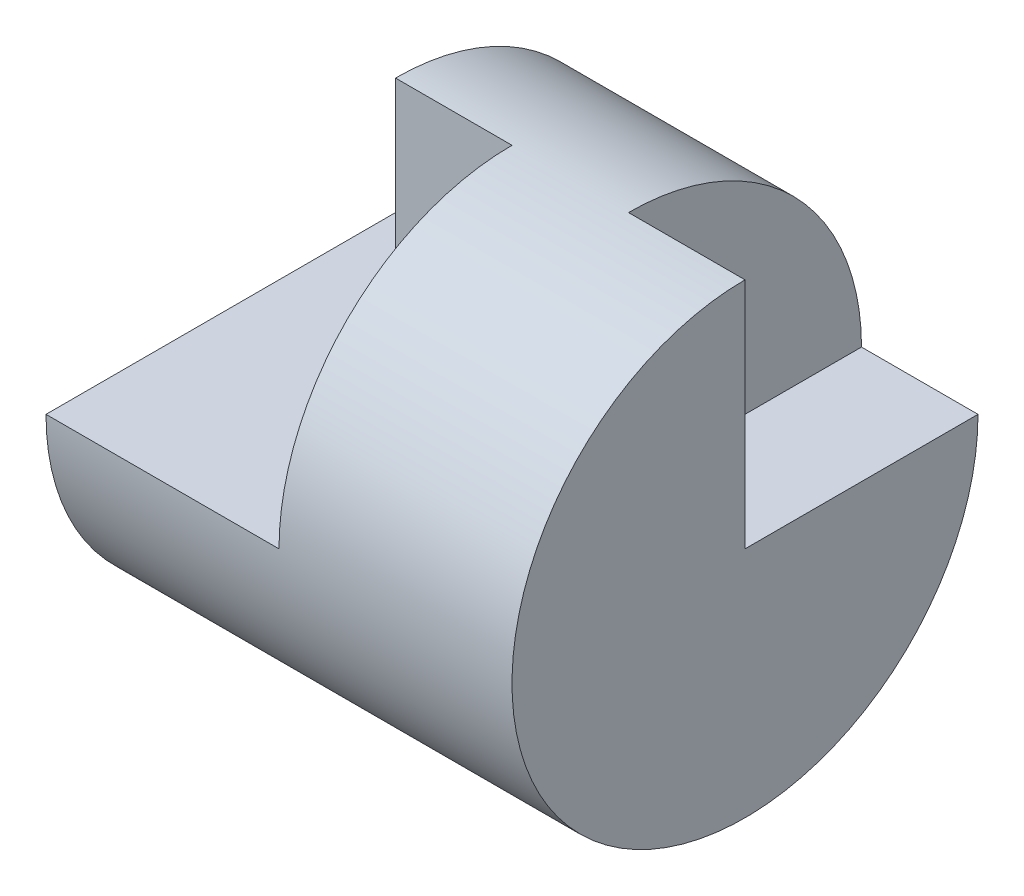
ISO-10303-21;
HEADER;
FILE_DESCRIPTION(('STEP AP214'),'2;1');
FILE_NAME('part.step','',(''),(''),'','','');
FILE_SCHEMA(('AUTOMOTIVE_DESIGN { 1 0 10303 214 1 1 1 1 }'));
ENDSEC;
DATA;
#1=APPLICATION_CONTEXT('core data for automotive mechanical design processes');
#2=APPLICATION_PROTOCOL_DEFINITION('international standard','automotive_design',2000,#1);
#3=PRODUCT_CONTEXT('',#1,'mechanical');
#4=PRODUCT('Part','Part','',(#3));
#5=PRODUCT_RELATED_PRODUCT_CATEGORY('part','',(#4));
#6=PRODUCT_DEFINITION_FORMATION('','',#4);
#7=PRODUCT_DEFINITION_CONTEXT('part definition',#1,'design');
#8=PRODUCT_DEFINITION('design','',#6,#7);
#9=PRODUCT_DEFINITION_SHAPE('','',#8);
#10=(LENGTH_UNIT() NAMED_UNIT(*) SI_UNIT(.MILLI.,.METRE.));
#11=(NAMED_UNIT(*) PLANE_ANGLE_UNIT() SI_UNIT($,.RADIAN.));
#12=(NAMED_UNIT(*) SI_UNIT($,.STERADIAN.) SOLID_ANGLE_UNIT());
#13=UNCERTAINTY_MEASURE_WITH_UNIT(LENGTH_MEASURE(1.E-05),#10,'distance_accuracy_value','');
#14=(GEOMETRIC_REPRESENTATION_CONTEXT(3) GLOBAL_UNCERTAINTY_ASSIGNED_CONTEXT((#13)) GLOBAL_UNIT_ASSIGNED_CONTEXT((#10,
#11,#12)) REPRESENTATION_CONTEXT('',''));
#15=CARTESIAN_POINT('',(0.,0.,0.));
#16=DIRECTION('',(0.,0.,1.));
#17=DIRECTION('',(1.,0.,0.));
#18=AXIS2_PLACEMENT_3D('',#15,#16,#17);
#19=CARTESIAN_POINT('',(0.,0.,0.));
#20=DIRECTION('',(-1.,0.,0.));
#21=DIRECTION('',(0.,0.,1.));
#22=AXIS2_PLACEMENT_3D('',#19,#20,#21);
#23=CYLINDRICAL_SURFACE('',#22,2.);
#24=CARTESIAN_POINT('',(2.,0.,0.));
#25=DIRECTION('',(1.,0.,0.));
#26=DIRECTION('',(0.,0.,-1.));
#27=AXIS2_PLACEMENT_3D('',#24,#25,#26);
#28=CIRCLE('',#27,2.);
#29=CARTESIAN_POINT('',(2.,0.,2.));
#30=VERTEX_POINT('',#29);
#31=CARTESIAN_POINT('',(2.,2.,0.));
#32=VERTEX_POINT('',#31);
#33=EDGE_CURVE('E11',#30,#32,#28,.F.);
#34=ORIENTED_EDGE('',*,*,#33,.F.);
#35=DIRECTION('',(-1.,0.,0.));
#36=VECTOR('',#35,1.);
#37=CARTESIAN_POINT('',(0.,0.,2.));
#38=LINE('',#37,#36);
#39=CARTESIAN_POINT('',(0.,0.,2.));
#40=VERTEX_POINT('',#39);
#41=EDGE_CURVE('E115',#40,#30,#38,.F.);
#42=ORIENTED_EDGE('',*,*,#41,.F.);
#43=CARTESIAN_POINT('',(0.,0.,0.));
#44=DIRECTION('',(-1.,0.,0.));
#45=DIRECTION('',(0.,0.,1.));
#46=AXIS2_PLACEMENT_3D('',#43,#44,#45);
#47=CIRCLE('',#46,2.);
#48=CARTESIAN_POINT('',(0.,0.,-2.));
#49=VERTEX_POINT('',#48);
#50=EDGE_CURVE('E140',#49,#40,#47,.T.);
#51=ORIENTED_EDGE('',*,*,#50,.F.);
#52=DIRECTION('',(-1.,0.,0.));
#53=VECTOR('',#52,1.);
#54=CARTESIAN_POINT('',(0.,0.,-2.));
#55=LINE('',#54,#53);
#56=CARTESIAN_POINT('',(1.,0.,-2.));
#57=VERTEX_POINT('',#56);
#58=EDGE_CURVE('E122',#57,#49,#55,.T.);
#59=ORIENTED_EDGE('',*,*,#58,.F.);
#60=CARTESIAN_POINT('',(1.,0.,0.));
#61=DIRECTION('',(-1.,0.,0.));
#62=DIRECTION('',(0.,-1.,0.));
#63=AXIS2_PLACEMENT_3D('',#60,#61,#62);
#64=CIRCLE('',#63,2.);
#65=CARTESIAN_POINT('',(1.,2.,0.));
#66=VERTEX_POINT('',#65);
#67=EDGE_CURVE('E40',#57,#66,#64,.F.);
#68=ORIENTED_EDGE('',*,*,#67,.T.);
#69=DIRECTION('',(1.,0.,0.));
#70=VECTOR('',#69,1.);
#71=CARTESIAN_POINT('',(0.5,2.,0.));
#72=LINE('',#71,#70);
#73=EDGE_CURVE('E103',#66,#32,#72,.T.);
#74=ORIENTED_EDGE('',*,*,#73,.T.);
#75=EDGE_LOOP('',(#34,#42,#51,#59,#68,#74));
#76=FACE_BOUND('',#75,.T.);
#77=CARTESIAN_POINT('',(3.,0.,0.));
#78=DIRECTION('',(-1.,0.,0.));
#79=DIRECTION('',(0.,-1.,0.));
#80=AXIS2_PLACEMENT_3D('',#77,#78,#79);
#81=CIRCLE('',#80,2.);
#82=CARTESIAN_POINT('',(3.,0.,-2.));
#83=VERTEX_POINT('',#82);
#84=CARTESIAN_POINT('',(3.,2.,0.));
#85=VERTEX_POINT('',#84);
#86=EDGE_CURVE('E144',#83,#85,#81,.F.);
#87=ORIENTED_EDGE('',*,*,#86,.F.);
#88=DIRECTION('',(-1.,0.,0.));
#89=VECTOR('',#88,1.);
#90=CARTESIAN_POINT('',(0.,0.,-2.));
#91=LINE('',#90,#89);
#92=CARTESIAN_POINT('',(4.,0.,-2.));
#93=VERTEX_POINT('',#92);
#94=EDGE_CURVE('E135',#83,#93,#91,.F.);
#95=ORIENTED_EDGE('',*,*,#94,.T.);
#96=CARTESIAN_POINT('',(4.,0.,0.));
#97=DIRECTION('',(-1.,0.,0.));
#98=DIRECTION('',(0.,0.,1.));
#99=AXIS2_PLACEMENT_3D('',#96,#97,#98);
#100=CIRCLE('',#99,2.);
#101=CARTESIAN_POINT('',(4.,2.,0.));
#102=VERTEX_POINT('',#101);
#103=EDGE_CURVE('E137',#93,#102,#100,.T.);
#104=ORIENTED_EDGE('',*,*,#103,.T.);
#105=DIRECTION('',(-1.,0.,0.));
#106=VECTOR('',#105,1.);
#107=CARTESIAN_POINT('',(0.,2.,0.));
#108=LINE('',#107,#106);
#109=EDGE_CURVE('E47',#102,#85,#108,.T.);
#110=ORIENTED_EDGE('',*,*,#109,.T.);
#111=EDGE_LOOP('',(#87,#95,#104,#110));
#112=FACE_BOUND('',#111,.T.);
#113=ADVANCED_FACE('F33',(#76,#112),#23,.T.);
#114=CARTESIAN_POINT('',(4.,0.,0.));
#115=DIRECTION('',(-1.,0.,0.));
#116=DIRECTION('',(0.,0.,1.));
#117=AXIS2_PLACEMENT_3D('',#114,#115,#116);
#118=PLANE('',#117);
#119=DIRECTION('',(0.,0.,-1.));
#120=VECTOR('',#119,1.);
#121=CARTESIAN_POINT('',(4.,0.,0.));
#122=LINE('',#121,#120);
#123=CARTESIAN_POINT('',(4.,0.,0.));
#124=VERTEX_POINT('',#123);
#125=EDGE_CURVE('E55',#124,#93,#122,.T.);
#126=ORIENTED_EDGE('',*,*,#125,.F.);
#127=DIRECTION('',(0.,-1.,0.));
#128=VECTOR('',#127,1.);
#129=CARTESIAN_POINT('',(4.,0.,0.));
#130=LINE('',#129,#128);
#131=EDGE_CURVE('E131',#102,#124,#130,.T.);
#132=ORIENTED_EDGE('',*,*,#131,.F.);
#133=ORIENTED_EDGE('',*,*,#103,.F.);
#134=EDGE_LOOP('',(#126,#132,#133));
#135=FACE_BOUND('',#134,.T.);
#136=ADVANCED_FACE('F167',(#135),#118,.F.);
#137=CARTESIAN_POINT('',(0.,-2.,0.));
#138=DIRECTION('',(1.,0.,0.));
#139=DIRECTION('',(0.,0.,-1.));
#140=AXIS2_PLACEMENT_3D('',#137,#138,#139);
#141=PLANE('',#140);
#142=ORIENTED_EDGE('',*,*,#50,.T.);
#143=DIRECTION('',(0.,0.,-1.));
#144=VECTOR('',#143,1.);
#145=CARTESIAN_POINT('',(0.,0.,0.));
#146=LINE('',#145,#144);
#147=EDGE_CURVE('E146',#40,#49,#146,.T.);
#148=ORIENTED_EDGE('',*,*,#147,.T.);
#149=EDGE_LOOP('',(#142,#148));
#150=FACE_BOUND('',#149,.T.);
#151=ADVANCED_FACE('F150',(#150),#141,.F.);
#152=CARTESIAN_POINT('',(0.,0.,-11.));
#153=DIRECTION('',(0.,1.,0.));
#154=DIRECTION('',(-1.,0.,0.));
#155=AXIS2_PLACEMENT_3D('',#152,#153,#154);
#156=PLANE('',#155);
#157=DIRECTION('',(0.,0.,1.));
#158=VECTOR('',#157,1.);
#159=CARTESIAN_POINT('',(3.,0.,-11.));
#160=LINE('',#159,#158);
#161=CARTESIAN_POINT('',(3.,0.,0.));
#162=VERTEX_POINT('',#161);
#163=EDGE_CURVE('E133',#83,#162,#160,.T.);
#164=ORIENTED_EDGE('',*,*,#163,.T.);
#165=DIRECTION('',(-1.,0.,0.));
#166=VECTOR('',#165,1.);
#167=CARTESIAN_POINT('',(0.,0.,0.));
#168=LINE('',#167,#166);
#169=EDGE_CURVE('E128',#124,#162,#168,.T.);
#170=ORIENTED_EDGE('',*,*,#169,.F.);
#171=ORIENTED_EDGE('',*,*,#125,.T.);
#172=ORIENTED_EDGE('',*,*,#94,.F.);
#173=EDGE_LOOP('',(#164,#170,#171,#172));
#174=FACE_BOUND('',#173,.T.);
#175=ADVANCED_FACE('F176',(#174),#156,.T.);
#176=CARTESIAN_POINT('',(3.,0.,-11.));
#177=DIRECTION('',(-1.,0.,0.));
#178=DIRECTION('',(0.,-1.,0.));
#179=AXIS2_PLACEMENT_3D('',#176,#177,#178);
#180=PLANE('',#179);
#181=ORIENTED_EDGE('',*,*,#86,.T.);
#182=DIRECTION('',(0.,-1.,0.));
#183=VECTOR('',#182,1.);
#184=CARTESIAN_POINT('',(3.,0.,0.));
#185=LINE('',#184,#183);
#186=EDGE_CURVE('E125',#85,#162,#185,.T.);
#187=ORIENTED_EDGE('',*,*,#186,.T.);
#188=ORIENTED_EDGE('',*,*,#163,.F.);
#189=EDGE_LOOP('',(#181,#187,#188));
#190=FACE_BOUND('',#189,.T.);
#191=ADVANCED_FACE('F164',(#190),#180,.F.);
#192=CARTESIAN_POINT('',(0.,0.,0.));
#193=DIRECTION('',(0.,0.,1.));
#194=DIRECTION('',(1.,0.,0.));
#195=AXIS2_PLACEMENT_3D('',#192,#193,#194);
#196=PLANE('',#195);
#197=ORIENTED_EDGE('',*,*,#109,.F.);
#198=ORIENTED_EDGE('',*,*,#131,.T.);
#199=ORIENTED_EDGE('',*,*,#169,.T.);
#200=ORIENTED_EDGE('',*,*,#186,.F.);
#201=EDGE_LOOP('',(#197,#198,#199,#200));
#202=FACE_BOUND('',#201,.T.);
#203=ADVANCED_FACE('F157',(#202),#196,.F.);
#204=CARTESIAN_POINT('',(1.,0.,-11.));
#205=DIRECTION('',(-1.,0.,0.));
#206=DIRECTION('',(0.,-1.,0.));
#207=AXIS2_PLACEMENT_3D('',#204,#205,#206);
#208=PLANE('',#207);
#209=DIRECTION('',(0.,0.,1.));
#210=VECTOR('',#209,1.);
#211=CARTESIAN_POINT('',(1.,0.,-11.));
#212=LINE('',#211,#210);
#213=CARTESIAN_POINT('',(1.,0.,0.));
#214=VERTEX_POINT('',#213);
#215=EDGE_CURVE('E119',#57,#214,#212,.T.);
#216=ORIENTED_EDGE('',*,*,#215,.T.);
#217=DIRECTION('',(0.,-1.,0.));
#218=VECTOR('',#217,1.);
#219=CARTESIAN_POINT('',(1.,0.,0.));
#220=LINE('',#219,#218);
#221=EDGE_CURVE('E117',#66,#214,#220,.T.);
#222=ORIENTED_EDGE('',*,*,#221,.F.);
#223=ORIENTED_EDGE('',*,*,#67,.F.);
#224=EDGE_LOOP('',(#216,#222,#223));
#225=FACE_BOUND('',#224,.T.);
#226=ADVANCED_FACE('F155',(#225),#208,.T.);
#227=CARTESIAN_POINT('',(0.,0.,-11.));
#228=DIRECTION('',(0.,-1.,0.));
#229=DIRECTION('',(1.,0.,0.));
#230=AXIS2_PLACEMENT_3D('',#227,#228,#229);
#231=PLANE('',#230);
#232=DIRECTION('',(-1.,0.,0.));
#233=VECTOR('',#232,1.);
#234=CARTESIAN_POINT('',(0.5,0.,0.));
#235=LINE('',#234,#233);
#236=CARTESIAN_POINT('',(2.,0.,0.));
#237=VERTEX_POINT('',#236);
#238=EDGE_CURVE('E106',#237,#214,#235,.T.);
#239=ORIENTED_EDGE('',*,*,#238,.T.);
#240=ORIENTED_EDGE('',*,*,#215,.F.);
#241=ORIENTED_EDGE('',*,*,#58,.T.);
#242=ORIENTED_EDGE('',*,*,#147,.F.);
#243=ORIENTED_EDGE('',*,*,#41,.T.);
#244=DIRECTION('',(0.,0.,-1.));
#245=VECTOR('',#244,1.);
#246=CARTESIAN_POINT('',(2.,0.,10.));
#247=LINE('',#246,#245);
#248=EDGE_CURVE('E97',#30,#237,#247,.T.);
#249=ORIENTED_EDGE('',*,*,#248,.T.);
#250=EDGE_LOOP('',(#239,#240,#241,#242,#243,#249));
#251=FACE_BOUND('',#250,.T.);
#252=ADVANCED_FACE('F152',(#251),#231,.F.);
#253=CARTESIAN_POINT('',(2.,0.,10.));
#254=DIRECTION('',(1.,0.,0.));
#255=DIRECTION('',(0.,0.,-1.));
#256=AXIS2_PLACEMENT_3D('',#253,#254,#255);
#257=PLANE('',#256);
#258=ORIENTED_EDGE('',*,*,#33,.T.);
#259=DIRECTION('',(0.,-1.,0.));
#260=VECTOR('',#259,1.);
#261=CARTESIAN_POINT('',(2.,0.,0.));
#262=LINE('',#261,#260);
#263=EDGE_CURVE('E95',#32,#237,#262,.T.);
#264=ORIENTED_EDGE('',*,*,#263,.T.);
#265=ORIENTED_EDGE('',*,*,#248,.F.);
#266=EDGE_LOOP('',(#258,#264,#265));
#267=FACE_BOUND('',#266,.T.);
#268=ADVANCED_FACE('F94',(#267),#257,.F.);
#269=CARTESIAN_POINT('',(0.,0.,0.));
#270=DIRECTION('',(0.,0.,-1.));
#271=DIRECTION('',(-1.,0.,0.));
#272=AXIS2_PLACEMENT_3D('',#269,#270,#271);
#273=PLANE('',#272);
#274=ORIENTED_EDGE('',*,*,#221,.T.);
#275=ORIENTED_EDGE('',*,*,#238,.F.);
#276=ORIENTED_EDGE('',*,*,#263,.F.);
#277=ORIENTED_EDGE('',*,*,#73,.F.);
#278=EDGE_LOOP('',(#274,#275,#276,#277));
#279=FACE_BOUND('',#278,.T.);
#280=ADVANCED_FACE('F102',(#279),#273,.F.);
#281=CLOSED_SHELL('',(#113,#136,#151,#175,#191,#203,#226,#252,#268,#280));
#282=MANIFOLD_SOLID_BREP('B2',#281);
#283=ADVANCED_BREP_SHAPE_REPRESENTATION('',(#18,#282),#14);
#284=SHAPE_DEFINITION_REPRESENTATION(#9,#283);
ENDSEC;
END-ISO-10303-21;
